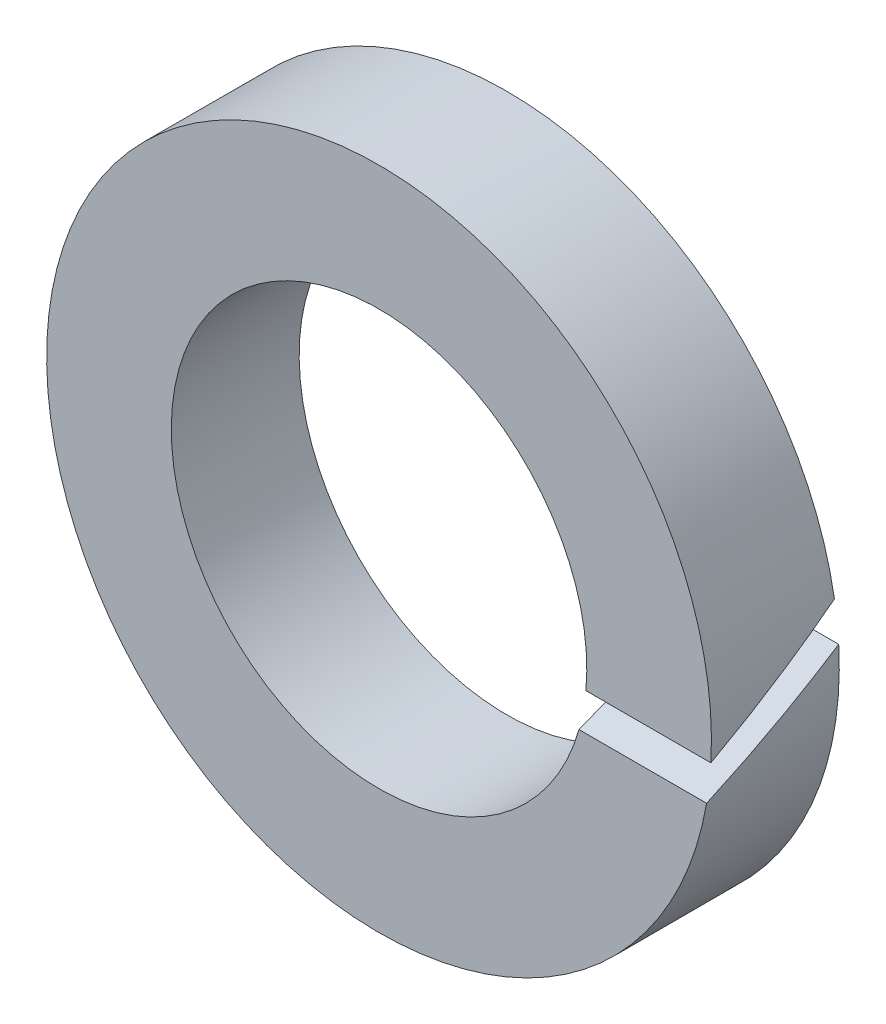
ISO-10303-21;
HEADER;
FILE_DESCRIPTION(('STEP AP214'),'2;1');
FILE_NAME('part.step','',(''),(''),'','','');
FILE_SCHEMA(('AUTOMOTIVE_DESIGN { 1 0 10303 214 1 1 1 1 }'));
ENDSEC;
DATA;
#1=APPLICATION_CONTEXT('core data for automotive mechanical design processes');
#2=APPLICATION_PROTOCOL_DEFINITION('international standard','automotive_design',2000,#1);
#3=PRODUCT_CONTEXT('',#1,'mechanical');
#4=PRODUCT('Part','Part','',(#3));
#5=PRODUCT_RELATED_PRODUCT_CATEGORY('part','',(#4));
#6=PRODUCT_DEFINITION_FORMATION('','',#4);
#7=PRODUCT_DEFINITION_CONTEXT('part definition',#1,'design');
#8=PRODUCT_DEFINITION('design','',#6,#7);
#9=PRODUCT_DEFINITION_SHAPE('','',#8);
#10=(LENGTH_UNIT() NAMED_UNIT(*) SI_UNIT(.MILLI.,.METRE.));
#11=(NAMED_UNIT(*) PLANE_ANGLE_UNIT() SI_UNIT($,.RADIAN.));
#12=(NAMED_UNIT(*) SI_UNIT($,.STERADIAN.) SOLID_ANGLE_UNIT());
#13=UNCERTAINTY_MEASURE_WITH_UNIT(LENGTH_MEASURE(1.E-05),#10,'distance_accuracy_value','');
#14=(GEOMETRIC_REPRESENTATION_CONTEXT(3) GLOBAL_UNCERTAINTY_ASSIGNED_CONTEXT((#13)) GLOBAL_UNIT_ASSIGNED_CONTEXT((#10,
#11,#12)) REPRESENTATION_CONTEXT('',''));
#15=CARTESIAN_POINT('',(0.,0.,0.));
#16=DIRECTION('',(0.,0.,1.));
#17=DIRECTION('',(1.,0.,0.));
#18=AXIS2_PLACEMENT_3D('',#15,#16,#17);
#19=CARTESIAN_POINT('',(0.,0.,2.));
#20=DIRECTION('',(0.,0.,1.));
#21=DIRECTION('',(1.,0.,0.));
#22=AXIS2_PLACEMENT_3D('',#19,#20,#21);
#23=PLANE('',#22);
#24=CARTESIAN_POINT('',(0.,0.,2.));
#25=DIRECTION('',(0.,0.,1.));
#26=DIRECTION('',(1.,0.,0.));
#27=AXIS2_PLACEMENT_3D('',#24,#25,#26);
#28=CIRCLE('',#27,5.2);
#29=CARTESIAN_POINT('',(5.19118452304954,-0.302660284231131,2.));
#30=VERTEX_POINT('',#29);
#31=CARTESIAN_POINT('',(5.12429988960151,-0.88405352859993,2.));
#32=VERTEX_POINT('',#31);
#33=EDGE_CURVE('E76',#30,#32,#28,.T.);
#34=ORIENTED_EDGE('',*,*,#33,.T.);
#35=DIRECTION('',(-1.,0.,0.));
#36=VECTOR('',#35,1.);
#37=CARTESIAN_POINT('',(5.19999999999999,-0.884053528599937,2.));
#38=LINE('',#37,#36);
#39=CARTESIAN_POINT('',(3.12745093623701,-0.884053528599944,2.));
#40=VERTEX_POINT('',#39);
#41=EDGE_CURVE('E78',#32,#40,#38,.T.);
#42=ORIENTED_EDGE('',*,*,#41,.T.);
#43=CARTESIAN_POINT('',(0.,0.,2.));
#44=DIRECTION('',(0.,0.,1.));
#45=DIRECTION('',(1.,0.,0.));
#46=AXIS2_PLACEMENT_3D('',#43,#44,#45);
#47=CIRCLE('',#46,3.25);
#48=CARTESIAN_POINT('',(3.23587650449598,-0.302660284231086,2.));
#49=VERTEX_POINT('',#48);
#50=EDGE_CURVE('E88',#49,#40,#47,.T.);
#51=ORIENTED_EDGE('',*,*,#50,.F.);
#52=DIRECTION('',(-1.,0.,0.));
#53=VECTOR('',#52,1.);
#54=CARTESIAN_POINT('',(5.20000000000001,-0.302660284231093,2.));
#55=LINE('',#54,#53);
#56=EDGE_CURVE('E52',#30,#49,#55,.T.);
#57=ORIENTED_EDGE('',*,*,#56,.F.);
#58=EDGE_LOOP('',(#34,#42,#51,#57));
#59=FACE_BOUND('',#58,.T.);
#60=ADVANCED_FACE('F30',(#59),#23,.T.);
#61=CARTESIAN_POINT('',(0.,0.,0.));
#62=DIRECTION('',(0.,0.,1.));
#63=DIRECTION('',(1.,0.,0.));
#64=AXIS2_PLACEMENT_3D('',#61,#62,#63);
#65=PLANE('',#64);
#66=DIRECTION('',(-1.,0.,0.));
#67=VECTOR('',#66,1.);
#68=CARTESIAN_POINT('',(5.19999999999999,0.302660284231052,0.));
#69=LINE('',#68,#67);
#70=CARTESIAN_POINT('',(5.19118452304954,0.302660284231072,0.));
#71=VERTEX_POINT('',#70);
#72=CARTESIAN_POINT('',(3.23587650449598,0.302660284231066,0.));
#73=VERTEX_POINT('',#72);
#74=EDGE_CURVE('E45',#71,#73,#69,.T.);
#75=ORIENTED_EDGE('',*,*,#74,.F.);
#76=CARTESIAN_POINT('',(0.,0.,0.));
#77=DIRECTION('',(0.,0.,1.));
#78=DIRECTION('',(1.,0.,0.));
#79=AXIS2_PLACEMENT_3D('',#76,#77,#78);
#80=CIRCLE('',#79,5.2);
#81=CARTESIAN_POINT('',(5.1242998896015,0.884053528599923,0.));
#82=VERTEX_POINT('',#81);
#83=EDGE_CURVE('E74',#82,#71,#80,.T.);
#84=ORIENTED_EDGE('',*,*,#83,.F.);
#85=DIRECTION('',(-1.,0.,0.));
#86=VECTOR('',#85,1.);
#87=CARTESIAN_POINT('',(5.19999999999999,0.884053528599958,0.));
#88=LINE('',#87,#86);
#89=CARTESIAN_POINT('',(3.12745093623703,0.884053528599951,0.));
#90=VERTEX_POINT('',#89);
#91=EDGE_CURVE('E81',#82,#90,#88,.T.);
#92=ORIENTED_EDGE('',*,*,#91,.T.);
#93=CARTESIAN_POINT('',(0.,0.,0.));
#94=DIRECTION('',(0.,0.,1.));
#95=DIRECTION('',(1.,0.,0.));
#96=AXIS2_PLACEMENT_3D('',#93,#94,#95);
#97=CIRCLE('',#96,3.25);
#98=EDGE_CURVE('E92',#90,#73,#97,.T.);
#99=ORIENTED_EDGE('',*,*,#98,.T.);
#100=EDGE_LOOP('',(#75,#84,#92,#99));
#101=FACE_BOUND('',#100,.T.);
#102=ADVANCED_FACE('F87',(#101),#65,.F.);
#103=CARTESIAN_POINT('',(0.,0.,2.));
#104=DIRECTION('',(0.,0.,-1.));
#105=DIRECTION('',(-1.,0.,0.));
#106=AXIS2_PLACEMENT_3D('',#103,#104,#105);
#107=CYLINDRICAL_SURFACE('',#106,5.2);
#108=CARTESIAN_POINT('',(0.,0.,0.51008133714911));
#109=DIRECTION('',(0.,0.860003112940855,0.510288786602295));
#110=DIRECTION('',(0.,0.510288786602297,-0.860003112940853));
#111=AXIS2_PLACEMENT_3D('',#108,#109,#110);
#112=ELLIPSE('',#111,10.1903081872985,5.2);
#113=EDGE_CURVE('E77',#32,#71,#112,.T.);
#114=ORIENTED_EDGE('',*,*,#113,.F.);
#115=ORIENTED_EDGE('',*,*,#33,.F.);
#116=CARTESIAN_POINT('',(0.,0.,1.48991866285089));
#117=DIRECTION('',(0.,0.860003112940855,0.510288786602295));
#118=DIRECTION('',(0.,0.510288786602297,-0.860003112940853));
#119=AXIS2_PLACEMENT_3D('',#116,#117,#118);
#120=ELLIPSE('',#119,10.1903081872985,5.2);
#121=EDGE_CURVE('E70',#30,#82,#120,.T.);
#122=ORIENTED_EDGE('',*,*,#121,.T.);
#123=ORIENTED_EDGE('',*,*,#83,.T.);
#124=EDGE_LOOP('',(#114,#115,#122,#123));
#125=FACE_BOUND('',#124,.T.);
#126=ADVANCED_FACE('F32',(#125),#107,.T.);
#127=CARTESIAN_POINT('',(0.,0.,2.));
#128=DIRECTION('',(0.,0.,-1.));
#129=DIRECTION('',(-1.,0.,0.));
#130=AXIS2_PLACEMENT_3D('',#127,#128,#129);
#131=CYLINDRICAL_SURFACE('',#130,3.25);
#132=ORIENTED_EDGE('',*,*,#50,.T.);
#133=CARTESIAN_POINT('',(0.,0.,0.51008133714911));
#134=DIRECTION('',(0.,0.860003112940855,0.510288786602295));
#135=DIRECTION('',(0.,0.510288786602297,-0.860003112940853));
#136=AXIS2_PLACEMENT_3D('',#133,#134,#135);
#137=ELLIPSE('',#136,6.36894261706158,3.25);
#138=EDGE_CURVE('E11',#40,#73,#137,.T.);
#139=ORIENTED_EDGE('',*,*,#138,.T.);
#140=ORIENTED_EDGE('',*,*,#98,.F.);
#141=CARTESIAN_POINT('',(0.,0.,1.48991866285089));
#142=DIRECTION('',(0.,0.860003112940855,0.510288786602295));
#143=DIRECTION('',(0.,0.510288786602297,-0.860003112940853));
#144=AXIS2_PLACEMENT_3D('',#141,#142,#143);
#145=ELLIPSE('',#144,6.36894261706158,3.25);
#146=EDGE_CURVE('E38',#49,#90,#145,.T.);
#147=ORIENTED_EDGE('',*,*,#146,.F.);
#148=EDGE_LOOP('',(#132,#139,#140,#147));
#149=FACE_BOUND('',#148,.T.);
#150=ADVANCED_FACE('F103',(#149),#131,.F.);
#151=CARTESIAN_POINT('',(5.20000000000001,-0.302660284231093,2.));
#152=DIRECTION('',(0.,0.860003112940855,0.510288786602295));
#153=DIRECTION('',(0.,-0.510288786602297,0.860003112940853));
#154=AXIS2_PLACEMENT_3D('',#151,#152,#153);
#155=PLANE('',#154);
#156=ORIENTED_EDGE('',*,*,#56,.T.);
#157=ORIENTED_EDGE('',*,*,#146,.T.);
#158=ORIENTED_EDGE('',*,*,#91,.F.);
#159=ORIENTED_EDGE('',*,*,#121,.F.);
#160=EDGE_LOOP('',(#156,#157,#158,#159));
#161=FACE_BOUND('',#160,.T.);
#162=ADVANCED_FACE('F82',(#161),#155,.F.);
#163=CARTESIAN_POINT('',(5.19999999999999,-0.884053528599937,2.));
#164=DIRECTION('',(0.,0.860003112940855,0.510288786602295));
#165=DIRECTION('',(0.,-0.510288786602297,0.860003112940853));
#166=AXIS2_PLACEMENT_3D('',#163,#164,#165);
#167=PLANE('',#166);
#168=ORIENTED_EDGE('',*,*,#113,.T.);
#169=ORIENTED_EDGE('',*,*,#74,.T.);
#170=ORIENTED_EDGE('',*,*,#138,.F.);
#171=ORIENTED_EDGE('',*,*,#41,.F.);
#172=EDGE_LOOP('',(#168,#169,#170,#171));
#173=FACE_BOUND('',#172,.T.);
#174=ADVANCED_FACE('F104',(#173),#167,.T.);
#175=CLOSED_SHELL('',(#60,#102,#126,#150,#162,#174));
#176=MANIFOLD_SOLID_BREP('B2',#175);
#177=ADVANCED_BREP_SHAPE_REPRESENTATION('',(#18,#176),#14);
#178=SHAPE_DEFINITION_REPRESENTATION(#9,#177);
ENDSEC;
END-ISO-10303-21;
